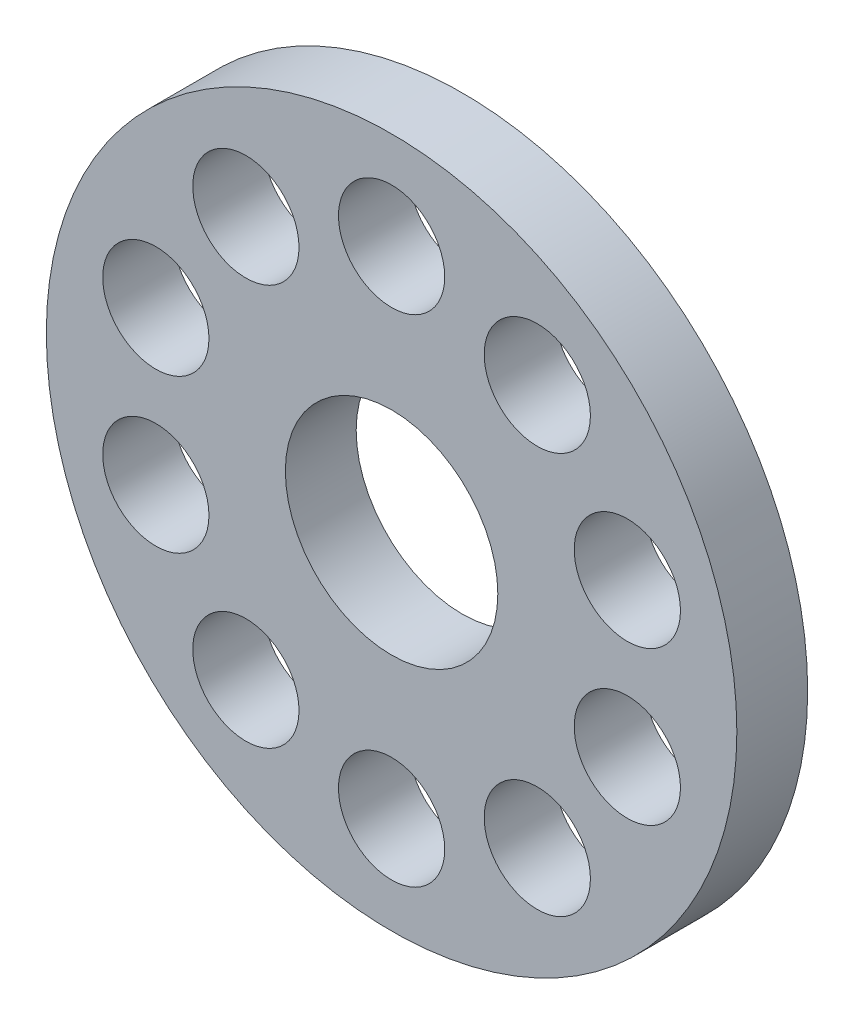
ISO-10303-21;
HEADER;
FILE_DESCRIPTION(('STEP AP214'),'2;1');
FILE_NAME('part.step','',(''),(''),'','','');
FILE_SCHEMA(('AUTOMOTIVE_DESIGN { 1 0 10303 214 1 1 1 1 }'));
ENDSEC;
DATA;
#1=APPLICATION_CONTEXT('core data for automotive mechanical design processes');
#2=APPLICATION_PROTOCOL_DEFINITION('international standard','automotive_design',2000,#1);
#3=PRODUCT_CONTEXT('',#1,'mechanical');
#4=PRODUCT('Part','Part','',(#3));
#5=PRODUCT_RELATED_PRODUCT_CATEGORY('part','',(#4));
#6=PRODUCT_DEFINITION_FORMATION('','',#4);
#7=PRODUCT_DEFINITION_CONTEXT('part definition',#1,'design');
#8=PRODUCT_DEFINITION('design','',#6,#7);
#9=PRODUCT_DEFINITION_SHAPE('','',#8);
#10=(LENGTH_UNIT() NAMED_UNIT(*) SI_UNIT(.MILLI.,.METRE.));
#11=(NAMED_UNIT(*) PLANE_ANGLE_UNIT() SI_UNIT($,.RADIAN.));
#12=(NAMED_UNIT(*) SI_UNIT($,.STERADIAN.) SOLID_ANGLE_UNIT());
#13=UNCERTAINTY_MEASURE_WITH_UNIT(LENGTH_MEASURE(1.E-05),#10,'distance_accuracy_value','');
#14=(GEOMETRIC_REPRESENTATION_CONTEXT(3) GLOBAL_UNCERTAINTY_ASSIGNED_CONTEXT((#13)) GLOBAL_UNIT_ASSIGNED_CONTEXT((#10,
#11,#12)) REPRESENTATION_CONTEXT('',''));
#15=CARTESIAN_POINT('',(0.,0.,0.));
#16=DIRECTION('',(0.,0.,1.));
#17=DIRECTION('',(1.,0.,0.));
#18=AXIS2_PLACEMENT_3D('',#15,#16,#17);
#19=CARTESIAN_POINT('',(0.,0.,-2.));
#20=DIRECTION('',(0.,0.,1.));
#21=DIRECTION('',(1.,0.,0.));
#22=AXIS2_PLACEMENT_3D('',#19,#20,#21);
#23=CYLINDRICAL_SURFACE('',#22,9.75);
#24=CARTESIAN_POINT('',(0.,0.,-2.));
#25=DIRECTION('',(0.,0.,1.));
#26=DIRECTION('',(1.,0.,0.));
#27=AXIS2_PLACEMENT_3D('',#24,#25,#26);
#28=CIRCLE('',#27,9.75);
#29=CARTESIAN_POINT('',(9.75,0.,-2.));
#30=VERTEX_POINT('',#29);
#31=EDGE_CURVE('E10',#30,#30,#28,.T.);
#32=ORIENTED_EDGE('',*,*,#31,.T.);
#33=EDGE_LOOP('',(#32));
#34=FACE_BOUND('',#33,.T.);
#35=CARTESIAN_POINT('',(0.,0.,0.));
#36=DIRECTION('',(0.,0.,1.));
#37=DIRECTION('',(1.,0.,0.));
#38=AXIS2_PLACEMENT_3D('',#35,#36,#37);
#39=CIRCLE('',#38,9.75);
#40=CARTESIAN_POINT('',(9.75,0.,0.));
#41=VERTEX_POINT('',#40);
#42=EDGE_CURVE('E31',#41,#41,#39,.T.);
#43=ORIENTED_EDGE('',*,*,#42,.F.);
#44=EDGE_LOOP('',(#43));
#45=FACE_BOUND('',#44,.T.);
#46=ADVANCED_FACE('F28',(#34,#45),#23,.T.);
#47=CARTESIAN_POINT('',(0.,0.,-2.));
#48=DIRECTION('',(0.,0.,1.));
#49=DIRECTION('',(1.,0.,0.));
#50=AXIS2_PLACEMENT_3D('',#47,#48,#49);
#51=PLANE('',#50);
#52=CARTESIAN_POINT('',(-4.11449676604724,5.66311896062469,-2.));
#53=DIRECTION('',(0.,0.,1.));
#54=DIRECTION('',(1.,0.,0.));
#55=AXIS2_PLACEMENT_3D('',#52,#53,#54);
#56=CIRCLE('',#55,1.5);
#57=CARTESIAN_POINT('',(-2.61449676604724,5.66311896062469,-2.));
#58=VERTEX_POINT('',#57);
#59=EDGE_CURVE('E97',#58,#58,#56,.T.);
#60=ORIENTED_EDGE('',*,*,#59,.T.);
#61=EDGE_LOOP('',(#60));
#62=FACE_BOUND('',#61,.T.);
#63=CARTESIAN_POINT('',(-6.65739561406605,2.16311896062471,-2.));
#64=DIRECTION('',(0.,0.,1.));
#65=DIRECTION('',(1.,0.,0.));
#66=AXIS2_PLACEMENT_3D('',#63,#64,#65);
#67=CIRCLE('',#66,1.5);
#68=CARTESIAN_POINT('',(-5.15739561406605,2.16311896062471,-2.));
#69=VERTEX_POINT('',#68);
#70=EDGE_CURVE('E91',#69,#69,#67,.T.);
#71=ORIENTED_EDGE('',*,*,#70,.T.);
#72=EDGE_LOOP('',(#71));
#73=FACE_BOUND('',#72,.T.);
#74=CARTESIAN_POINT('',(-6.65739561406595,-2.16311896062472,-2.));
#75=DIRECTION('',(0.,0.,1.));
#76=DIRECTION('',(1.,0.,0.));
#77=AXIS2_PLACEMENT_3D('',#74,#75,#76);
#78=CIRCLE('',#77,1.50000000000021);
#79=CARTESIAN_POINT('',(-5.15739561406574,-2.16311896062472,-2.));
#80=VERTEX_POINT('',#79);
#81=EDGE_CURVE('E85',#80,#80,#78,.T.);
#82=ORIENTED_EDGE('',*,*,#81,.T.);
#83=EDGE_LOOP('',(#82));
#84=FACE_BOUND('',#83,.T.);
#85=CARTESIAN_POINT('',(-4.11449676604714,-5.66311896062469,-2.));
#86=DIRECTION('',(0.,0.,1.));
#87=DIRECTION('',(1.,0.,0.));
#88=AXIS2_PLACEMENT_3D('',#85,#86,#87);
#89=CIRCLE('',#88,1.50000000000024);
#90=CARTESIAN_POINT('',(-2.61449676604689,-5.66311896062469,-2.));
#91=VERTEX_POINT('',#90);
#92=EDGE_CURVE('E79',#91,#91,#89,.T.);
#93=ORIENTED_EDGE('',*,*,#92,.T.);
#94=EDGE_LOOP('',(#93));
#95=FACE_BOUND('',#94,.T.);
#96=CARTESIAN_POINT('',(1.95495437423423E-13,-7.,-2.));
#97=DIRECTION('',(0.,0.,1.));
#98=DIRECTION('',(1.,0.,0.));
#99=AXIS2_PLACEMENT_3D('',#96,#97,#98);
#100=CIRCLE('',#99,1.50000000000023);
#101=CARTESIAN_POINT('',(1.50000000000043,-7.,-2.));
#102=VERTEX_POINT('',#101);
#103=EDGE_CURVE('E73',#102,#102,#100,.T.);
#104=ORIENTED_EDGE('',*,*,#103,.T.);
#105=EDGE_LOOP('',(#104));
#106=FACE_BOUND('',#105,.T.);
#107=CARTESIAN_POINT('',(4.11449676604749,-5.66311896062458,-2.));
#108=DIRECTION('',(0.,0.,1.));
#109=DIRECTION('',(1.,0.,0.));
#110=AXIS2_PLACEMENT_3D('',#107,#108,#109);
#111=CIRCLE('',#110,1.50000000000019);
#112=CARTESIAN_POINT('',(5.61449676604768,-5.66311896062458,-2.));
#113=VERTEX_POINT('',#112);
#114=EDGE_CURVE('E67',#113,#113,#111,.T.);
#115=ORIENTED_EDGE('',*,*,#114,.T.);
#116=EDGE_LOOP('',(#115));
#117=FACE_BOUND('',#116,.T.);
#118=CARTESIAN_POINT('',(6.65739561406607,-2.16311896062466,-2.));
#119=DIRECTION('',(0.,0.,1.));
#120=DIRECTION('',(1.,0.,0.));
#121=AXIS2_PLACEMENT_3D('',#118,#119,#120);
#122=CIRCLE('',#121,1.5);
#123=CARTESIAN_POINT('',(8.15739561406607,-2.16311896062466,-2.));
#124=VERTEX_POINT('',#123);
#125=EDGE_CURVE('E61',#124,#124,#122,.T.);
#126=ORIENTED_EDGE('',*,*,#125,.T.);
#127=EDGE_LOOP('',(#126));
#128=FACE_BOUND('',#127,.T.);
#129=CARTESIAN_POINT('',(6.65739561406608,2.16311896062461,-2.));
#130=DIRECTION('',(0.,0.,1.));
#131=DIRECTION('',(1.,0.,0.));
#132=AXIS2_PLACEMENT_3D('',#129,#130,#131);
#133=CIRCLE('',#132,1.5);
#134=CARTESIAN_POINT('',(8.15739561406608,2.16311896062461,-2.));
#135=VERTEX_POINT('',#134);
#136=EDGE_CURVE('E55',#135,#135,#133,.T.);
#137=ORIENTED_EDGE('',*,*,#136,.T.);
#138=EDGE_LOOP('',(#137));
#139=FACE_BOUND('',#138,.T.);
#140=CARTESIAN_POINT('',(4.11449676604732,5.66311896062463,-2.));
#141=DIRECTION('',(0.,0.,1.));
#142=DIRECTION('',(1.,0.,0.));
#143=AXIS2_PLACEMENT_3D('',#140,#141,#142);
#144=CIRCLE('',#143,1.5);
#145=CARTESIAN_POINT('',(5.61449676604732,5.66311896062463,-2.));
#146=VERTEX_POINT('',#145);
#147=EDGE_CURVE('E49',#146,#146,#144,.T.);
#148=ORIENTED_EDGE('',*,*,#147,.T.);
#149=EDGE_LOOP('',(#148));
#150=FACE_BOUND('',#149,.T.);
#151=CARTESIAN_POINT('',(0.,7.,-2.));
#152=DIRECTION('',(0.,0.,1.));
#153=DIRECTION('',(1.,0.,0.));
#154=AXIS2_PLACEMENT_3D('',#151,#152,#153);
#155=CIRCLE('',#154,1.5);
#156=CARTESIAN_POINT('',(1.5,7.,-2.));
#157=VERTEX_POINT('',#156);
#158=EDGE_CURVE('E43',#157,#157,#155,.T.);
#159=ORIENTED_EDGE('',*,*,#158,.T.);
#160=EDGE_LOOP('',(#159));
#161=FACE_BOUND('',#160,.T.);
#162=CARTESIAN_POINT('',(0.,0.,-2.));
#163=DIRECTION('',(0.,0.,1.));
#164=DIRECTION('',(1.,0.,0.));
#165=AXIS2_PLACEMENT_3D('',#162,#163,#164);
#166=CIRCLE('',#165,3.);
#167=CARTESIAN_POINT('',(3.,0.,-2.));
#168=VERTEX_POINT('',#167);
#169=EDGE_CURVE('E38',#168,#168,#166,.T.);
#170=ORIENTED_EDGE('',*,*,#169,.T.);
#171=EDGE_LOOP('',(#170));
#172=FACE_BOUND('',#171,.T.);
#173=ORIENTED_EDGE('',*,*,#31,.F.);
#174=EDGE_LOOP('',(#173));
#175=FACE_BOUND('',#174,.T.);
#176=ADVANCED_FACE('F106',(#62,#73,#84,#95,#106,#117,#128,#139,#150,#161,#172,#175),#51,.F.);
#177=CARTESIAN_POINT('',(0.,0.,0.));
#178=DIRECTION('',(0.,0.,1.));
#179=DIRECTION('',(1.,0.,0.));
#180=AXIS2_PLACEMENT_3D('',#177,#178,#179);
#181=PLANE('',#180);
#182=CARTESIAN_POINT('',(-4.11449676604724,5.66311896062469,0.));
#183=DIRECTION('',(0.,0.,1.));
#184=DIRECTION('',(1.,0.,0.));
#185=AXIS2_PLACEMENT_3D('',#182,#183,#184);
#186=CIRCLE('',#185,1.5);
#187=CARTESIAN_POINT('',(-2.61449676604724,5.66311896062469,0.));
#188=VERTEX_POINT('',#187);
#189=EDGE_CURVE('E100',#188,#188,#186,.T.);
#190=ORIENTED_EDGE('',*,*,#189,.F.);
#191=EDGE_LOOP('',(#190));
#192=FACE_BOUND('',#191,.T.);
#193=CARTESIAN_POINT('',(-6.65739561406605,2.16311896062471,0.));
#194=DIRECTION('',(0.,0.,1.));
#195=DIRECTION('',(1.,0.,0.));
#196=AXIS2_PLACEMENT_3D('',#193,#194,#195);
#197=CIRCLE('',#196,1.5);
#198=CARTESIAN_POINT('',(-5.15739561406605,2.16311896062471,0.));
#199=VERTEX_POINT('',#198);
#200=EDGE_CURVE('E94',#199,#199,#197,.T.);
#201=ORIENTED_EDGE('',*,*,#200,.F.);
#202=EDGE_LOOP('',(#201));
#203=FACE_BOUND('',#202,.T.);
#204=CARTESIAN_POINT('',(-6.65739561406595,-2.16311896062472,0.));
#205=DIRECTION('',(0.,0.,1.));
#206=DIRECTION('',(1.,0.,0.));
#207=AXIS2_PLACEMENT_3D('',#204,#205,#206);
#208=CIRCLE('',#207,1.50000000000021);
#209=CARTESIAN_POINT('',(-5.15739561406574,-2.16311896062472,0.));
#210=VERTEX_POINT('',#209);
#211=EDGE_CURVE('E88',#210,#210,#208,.T.);
#212=ORIENTED_EDGE('',*,*,#211,.F.);
#213=EDGE_LOOP('',(#212));
#214=FACE_BOUND('',#213,.T.);
#215=CARTESIAN_POINT('',(-4.11449676604714,-5.66311896062469,0.));
#216=DIRECTION('',(0.,0.,1.));
#217=DIRECTION('',(1.,0.,0.));
#218=AXIS2_PLACEMENT_3D('',#215,#216,#217);
#219=CIRCLE('',#218,1.50000000000024);
#220=CARTESIAN_POINT('',(-2.61449676604689,-5.66311896062469,0.));
#221=VERTEX_POINT('',#220);
#222=EDGE_CURVE('E82',#221,#221,#219,.T.);
#223=ORIENTED_EDGE('',*,*,#222,.F.);
#224=EDGE_LOOP('',(#223));
#225=FACE_BOUND('',#224,.T.);
#226=CARTESIAN_POINT('',(1.95495437423423E-13,-7.,0.));
#227=DIRECTION('',(0.,0.,1.));
#228=DIRECTION('',(1.,0.,0.));
#229=AXIS2_PLACEMENT_3D('',#226,#227,#228);
#230=CIRCLE('',#229,1.50000000000023);
#231=CARTESIAN_POINT('',(1.50000000000043,-7.,0.));
#232=VERTEX_POINT('',#231);
#233=EDGE_CURVE('E76',#232,#232,#230,.T.);
#234=ORIENTED_EDGE('',*,*,#233,.F.);
#235=EDGE_LOOP('',(#234));
#236=FACE_BOUND('',#235,.T.);
#237=CARTESIAN_POINT('',(4.11449676604749,-5.66311896062458,0.));
#238=DIRECTION('',(0.,0.,1.));
#239=DIRECTION('',(1.,0.,0.));
#240=AXIS2_PLACEMENT_3D('',#237,#238,#239);
#241=CIRCLE('',#240,1.50000000000019);
#242=CARTESIAN_POINT('',(5.61449676604768,-5.66311896062458,0.));
#243=VERTEX_POINT('',#242);
#244=EDGE_CURVE('E70',#243,#243,#241,.T.);
#245=ORIENTED_EDGE('',*,*,#244,.F.);
#246=EDGE_LOOP('',(#245));
#247=FACE_BOUND('',#246,.T.);
#248=CARTESIAN_POINT('',(6.65739561406607,-2.16311896062466,0.));
#249=DIRECTION('',(0.,0.,1.));
#250=DIRECTION('',(1.,0.,0.));
#251=AXIS2_PLACEMENT_3D('',#248,#249,#250);
#252=CIRCLE('',#251,1.5);
#253=CARTESIAN_POINT('',(8.15739561406607,-2.16311896062466,0.));
#254=VERTEX_POINT('',#253);
#255=EDGE_CURVE('E64',#254,#254,#252,.T.);
#256=ORIENTED_EDGE('',*,*,#255,.F.);
#257=EDGE_LOOP('',(#256));
#258=FACE_BOUND('',#257,.T.);
#259=CARTESIAN_POINT('',(6.65739561406608,2.16311896062461,0.));
#260=DIRECTION('',(0.,0.,1.));
#261=DIRECTION('',(1.,0.,0.));
#262=AXIS2_PLACEMENT_3D('',#259,#260,#261);
#263=CIRCLE('',#262,1.5);
#264=CARTESIAN_POINT('',(8.15739561406608,2.16311896062461,0.));
#265=VERTEX_POINT('',#264);
#266=EDGE_CURVE('E58',#265,#265,#263,.T.);
#267=ORIENTED_EDGE('',*,*,#266,.F.);
#268=EDGE_LOOP('',(#267));
#269=FACE_BOUND('',#268,.T.);
#270=CARTESIAN_POINT('',(4.11449676604732,5.66311896062463,0.));
#271=DIRECTION('',(0.,0.,1.));
#272=DIRECTION('',(1.,0.,0.));
#273=AXIS2_PLACEMENT_3D('',#270,#271,#272);
#274=CIRCLE('',#273,1.5);
#275=CARTESIAN_POINT('',(5.61449676604732,5.66311896062463,0.));
#276=VERTEX_POINT('',#275);
#277=EDGE_CURVE('E52',#276,#276,#274,.T.);
#278=ORIENTED_EDGE('',*,*,#277,.F.);
#279=EDGE_LOOP('',(#278));
#280=FACE_BOUND('',#279,.T.);
#281=CARTESIAN_POINT('',(0.,7.,0.));
#282=DIRECTION('',(0.,0.,1.));
#283=DIRECTION('',(1.,0.,0.));
#284=AXIS2_PLACEMENT_3D('',#281,#282,#283);
#285=CIRCLE('',#284,1.5);
#286=CARTESIAN_POINT('',(1.5,7.,0.));
#287=VERTEX_POINT('',#286);
#288=EDGE_CURVE('E46',#287,#287,#285,.T.);
#289=ORIENTED_EDGE('',*,*,#288,.F.);
#290=EDGE_LOOP('',(#289));
#291=FACE_BOUND('',#290,.T.);
#292=CARTESIAN_POINT('',(0.,0.,0.));
#293=DIRECTION('',(0.,0.,1.));
#294=DIRECTION('',(1.,0.,0.));
#295=AXIS2_PLACEMENT_3D('',#292,#293,#294);
#296=CIRCLE('',#295,3.);
#297=CARTESIAN_POINT('',(3.,0.,0.));
#298=VERTEX_POINT('',#297);
#299=EDGE_CURVE('E40',#298,#298,#296,.T.);
#300=ORIENTED_EDGE('',*,*,#299,.F.);
#301=EDGE_LOOP('',(#300));
#302=FACE_BOUND('',#301,.T.);
#303=ORIENTED_EDGE('',*,*,#42,.T.);
#304=EDGE_LOOP('',(#303));
#305=FACE_BOUND('',#304,.T.);
#306=ADVANCED_FACE('F116',(#192,#203,#214,#225,#236,#247,#258,#269,#280,#291,#302,#305),#181,.T.);
#307=CARTESIAN_POINT('',(0.,0.,-2.));
#308=DIRECTION('',(0.,0.,1.));
#309=DIRECTION('',(1.,0.,0.));
#310=AXIS2_PLACEMENT_3D('',#307,#308,#309);
#311=CYLINDRICAL_SURFACE('',#310,3.);
#312=ORIENTED_EDGE('',*,*,#169,.F.);
#313=EDGE_LOOP('',(#312));
#314=FACE_BOUND('',#313,.T.);
#315=ORIENTED_EDGE('',*,*,#299,.T.);
#316=EDGE_LOOP('',(#315));
#317=FACE_BOUND('',#316,.T.);
#318=ADVANCED_FACE('F119',(#314,#317),#311,.F.);
#319=CARTESIAN_POINT('',(0.,7.,-2.));
#320=DIRECTION('',(0.,0.,1.));
#321=DIRECTION('',(1.,0.,0.));
#322=AXIS2_PLACEMENT_3D('',#319,#320,#321);
#323=CYLINDRICAL_SURFACE('',#322,1.5);
#324=ORIENTED_EDGE('',*,*,#158,.F.);
#325=EDGE_LOOP('',(#324));
#326=FACE_BOUND('',#325,.T.);
#327=ORIENTED_EDGE('',*,*,#288,.T.);
#328=EDGE_LOOP('',(#327));
#329=FACE_BOUND('',#328,.T.);
#330=ADVANCED_FACE('F152',(#326,#329),#323,.F.);
#331=CARTESIAN_POINT('',(4.11449676604732,5.66311896062463,-2.));
#332=DIRECTION('',(0.,0.,1.));
#333=DIRECTION('',(1.,0.,0.));
#334=AXIS2_PLACEMENT_3D('',#331,#332,#333);
#335=CYLINDRICAL_SURFACE('',#334,1.5);
#336=ORIENTED_EDGE('',*,*,#147,.F.);
#337=EDGE_LOOP('',(#336));
#338=FACE_BOUND('',#337,.T.);
#339=ORIENTED_EDGE('',*,*,#277,.T.);
#340=EDGE_LOOP('',(#339));
#341=FACE_BOUND('',#340,.T.);
#342=ADVANCED_FACE('F156',(#338,#341),#335,.F.);
#343=CARTESIAN_POINT('',(6.65739561406608,2.16311896062461,-2.));
#344=DIRECTION('',(0.,0.,1.));
#345=DIRECTION('',(1.,0.,0.));
#346=AXIS2_PLACEMENT_3D('',#343,#344,#345);
#347=CYLINDRICAL_SURFACE('',#346,1.5);
#348=ORIENTED_EDGE('',*,*,#136,.F.);
#349=EDGE_LOOP('',(#348));
#350=FACE_BOUND('',#349,.T.);
#351=ORIENTED_EDGE('',*,*,#266,.T.);
#352=EDGE_LOOP('',(#351));
#353=FACE_BOUND('',#352,.T.);
#354=ADVANCED_FACE('F160',(#350,#353),#347,.F.);
#355=CARTESIAN_POINT('',(6.65739561406607,-2.16311896062466,-2.));
#356=DIRECTION('',(0.,0.,1.));
#357=DIRECTION('',(1.,0.,0.));
#358=AXIS2_PLACEMENT_3D('',#355,#356,#357);
#359=CYLINDRICAL_SURFACE('',#358,1.5);
#360=ORIENTED_EDGE('',*,*,#125,.F.);
#361=EDGE_LOOP('',(#360));
#362=FACE_BOUND('',#361,.T.);
#363=ORIENTED_EDGE('',*,*,#255,.T.);
#364=EDGE_LOOP('',(#363));
#365=FACE_BOUND('',#364,.T.);
#366=ADVANCED_FACE('F164',(#362,#365),#359,.F.);
#367=CARTESIAN_POINT('',(4.11449676604749,-5.66311896062458,-2.));
#368=DIRECTION('',(0.,0.,1.));
#369=DIRECTION('',(1.,0.,0.));
#370=AXIS2_PLACEMENT_3D('',#367,#368,#369);
#371=CYLINDRICAL_SURFACE('',#370,1.50000000000019);
#372=ORIENTED_EDGE('',*,*,#114,.F.);
#373=EDGE_LOOP('',(#372));
#374=FACE_BOUND('',#373,.T.);
#375=ORIENTED_EDGE('',*,*,#244,.T.);
#376=EDGE_LOOP('',(#375));
#377=FACE_BOUND('',#376,.T.);
#378=ADVANCED_FACE('F168',(#374,#377),#371,.F.);
#379=CARTESIAN_POINT('',(1.95495437423423E-13,-7.,-2.));
#380=DIRECTION('',(0.,0.,1.));
#381=DIRECTION('',(1.,0.,0.));
#382=AXIS2_PLACEMENT_3D('',#379,#380,#381);
#383=CYLINDRICAL_SURFACE('',#382,1.50000000000023);
#384=ORIENTED_EDGE('',*,*,#103,.F.);
#385=EDGE_LOOP('',(#384));
#386=FACE_BOUND('',#385,.T.);
#387=ORIENTED_EDGE('',*,*,#233,.T.);
#388=EDGE_LOOP('',(#387));
#389=FACE_BOUND('',#388,.T.);
#390=ADVANCED_FACE('F172',(#386,#389),#383,.F.);
#391=CARTESIAN_POINT('',(-4.11449676604714,-5.66311896062469,-2.));
#392=DIRECTION('',(0.,0.,1.));
#393=DIRECTION('',(1.,0.,0.));
#394=AXIS2_PLACEMENT_3D('',#391,#392,#393);
#395=CYLINDRICAL_SURFACE('',#394,1.50000000000024);
#396=ORIENTED_EDGE('',*,*,#92,.F.);
#397=EDGE_LOOP('',(#396));
#398=FACE_BOUND('',#397,.T.);
#399=ORIENTED_EDGE('',*,*,#222,.T.);
#400=EDGE_LOOP('',(#399));
#401=FACE_BOUND('',#400,.T.);
#402=ADVANCED_FACE('F176',(#398,#401),#395,.F.);
#403=CARTESIAN_POINT('',(-6.65739561406595,-2.16311896062472,-2.));
#404=DIRECTION('',(0.,0.,1.));
#405=DIRECTION('',(1.,0.,0.));
#406=AXIS2_PLACEMENT_3D('',#403,#404,#405);
#407=CYLINDRICAL_SURFACE('',#406,1.50000000000021);
#408=ORIENTED_EDGE('',*,*,#81,.F.);
#409=EDGE_LOOP('',(#408));
#410=FACE_BOUND('',#409,.T.);
#411=ORIENTED_EDGE('',*,*,#211,.T.);
#412=EDGE_LOOP('',(#411));
#413=FACE_BOUND('',#412,.T.);
#414=ADVANCED_FACE('F180',(#410,#413),#407,.F.);
#415=CARTESIAN_POINT('',(-6.65739561406605,2.16311896062471,-2.));
#416=DIRECTION('',(0.,0.,1.));
#417=DIRECTION('',(1.,0.,0.));
#418=AXIS2_PLACEMENT_3D('',#415,#416,#417);
#419=CYLINDRICAL_SURFACE('',#418,1.5);
#420=ORIENTED_EDGE('',*,*,#70,.F.);
#421=EDGE_LOOP('',(#420));
#422=FACE_BOUND('',#421,.T.);
#423=ORIENTED_EDGE('',*,*,#200,.T.);
#424=EDGE_LOOP('',(#423));
#425=FACE_BOUND('',#424,.T.);
#426=ADVANCED_FACE('F112',(#422,#425),#419,.F.);
#427=CARTESIAN_POINT('',(-4.11449676604724,5.66311896062469,-2.));
#428=DIRECTION('',(0.,0.,1.));
#429=DIRECTION('',(1.,0.,0.));
#430=AXIS2_PLACEMENT_3D('',#427,#428,#429);
#431=CYLINDRICAL_SURFACE('',#430,1.5);
#432=ORIENTED_EDGE('',*,*,#59,.F.);
#433=EDGE_LOOP('',(#432));
#434=FACE_BOUND('',#433,.T.);
#435=ORIENTED_EDGE('',*,*,#189,.T.);
#436=EDGE_LOOP('',(#435));
#437=FACE_BOUND('',#436,.T.);
#438=ADVANCED_FACE('F109',(#434,#437),#431,.F.);
#439=CLOSED_SHELL('',(#46,#176,#306,#318,#330,#342,#354,#366,#378,#390,#402,#414,#426,#438));
#440=MANIFOLD_SOLID_BREP('B2',#439);
#441=ADVANCED_BREP_SHAPE_REPRESENTATION('',(#18,#440),#14);
#442=SHAPE_DEFINITION_REPRESENTATION(#9,#441);
ENDSEC;
END-ISO-10303-21;
